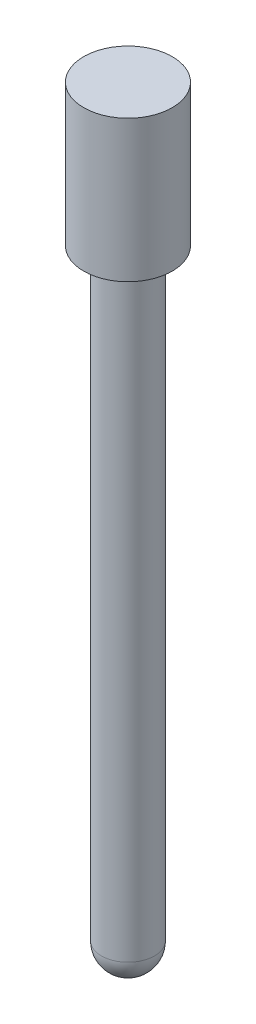
ISO-10303-21;
HEADER;
FILE_DESCRIPTION(('STEP AP214'),'2;1');
FILE_NAME('part.step','',(''),(''),'','','');
FILE_SCHEMA(('AUTOMOTIVE_DESIGN { 1 0 10303 214 1 1 1 1 }'));
ENDSEC;
DATA;
#1=APPLICATION_CONTEXT('core data for automotive mechanical design processes');
#2=APPLICATION_PROTOCOL_DEFINITION('international standard','automotive_design',2000,#1);
#3=PRODUCT_CONTEXT('',#1,'mechanical');
#4=PRODUCT('Part','Part','',(#3));
#5=PRODUCT_RELATED_PRODUCT_CATEGORY('part','',(#4));
#6=PRODUCT_DEFINITION_FORMATION('','',#4);
#7=PRODUCT_DEFINITION_CONTEXT('part definition',#1,'design');
#8=PRODUCT_DEFINITION('design','',#6,#7);
#9=PRODUCT_DEFINITION_SHAPE('','',#8);
#10=(LENGTH_UNIT() NAMED_UNIT(*) SI_UNIT(.MILLI.,.METRE.));
#11=(NAMED_UNIT(*) PLANE_ANGLE_UNIT() SI_UNIT($,.RADIAN.));
#12=(NAMED_UNIT(*) SI_UNIT($,.STERADIAN.) SOLID_ANGLE_UNIT());
#13=UNCERTAINTY_MEASURE_WITH_UNIT(LENGTH_MEASURE(1.E-05),#10,'distance_accuracy_value','');
#14=(GEOMETRIC_REPRESENTATION_CONTEXT(3) GLOBAL_UNCERTAINTY_ASSIGNED_CONTEXT((#13)) GLOBAL_UNIT_ASSIGNED_CONTEXT((#10,
#11,#12)) REPRESENTATION_CONTEXT('',''));
#15=CARTESIAN_POINT('',(0.,0.,0.));
#16=DIRECTION('',(0.,0.,1.));
#17=DIRECTION('',(1.,0.,0.));
#18=AXIS2_PLACEMENT_3D('',#15,#16,#17);
#19=CARTESIAN_POINT('',(0.,0.,0.));
#20=DIRECTION('',(0.,1.,0.));
#21=DIRECTION('',(0.,0.,1.));
#22=AXIS2_PLACEMENT_3D('',#19,#20,#21);
#23=PLANE('',#22);
#24=CARTESIAN_POINT('',(0.,0.,0.));
#25=DIRECTION('',(0.,1.,0.));
#26=DIRECTION('',(0.,0.,1.));
#27=AXIS2_PLACEMENT_3D('',#24,#25,#26);
#28=CIRCLE('',#27,7.9375);
#29=CARTESIAN_POINT('',(0.,0.,7.9375));
#30=VERTEX_POINT('',#29);
#31=EDGE_CURVE('E43',#30,#30,#28,.T.);
#32=ORIENTED_EDGE('',*,*,#31,.F.);
#33=EDGE_LOOP('',(#32));
#34=FACE_BOUND('',#33,.T.);
#35=CARTESIAN_POINT('',(0.,0.,0.));
#36=DIRECTION('',(0.,1.,0.));
#37=DIRECTION('',(0.,0.,1.));
#38=AXIS2_PLACEMENT_3D('',#35,#36,#37);
#39=CIRCLE('',#38,4.7625);
#40=CARTESIAN_POINT('',(0.,0.,4.7625));
#41=VERTEX_POINT('',#40);
#42=EDGE_CURVE('E10',#41,#41,#39,.F.);
#43=ORIENTED_EDGE('',*,*,#42,.F.);
#44=EDGE_LOOP('',(#43));
#45=FACE_BOUND('',#44,.T.);
#46=ADVANCED_FACE('F31',(#34,#45),#23,.F.);
#47=CARTESIAN_POINT('',(0.,25.4,0.));
#48=DIRECTION('',(0.,-1.,0.));
#49=DIRECTION('',(0.,0.,-1.));
#50=AXIS2_PLACEMENT_3D('',#47,#48,#49);
#51=CYLINDRICAL_SURFACE('',#50,7.9375);
#52=CARTESIAN_POINT('',(0.,25.4,0.));
#53=DIRECTION('',(0.,1.,0.));
#54=DIRECTION('',(0.,0.,1.));
#55=AXIS2_PLACEMENT_3D('',#52,#53,#54);
#56=CIRCLE('',#55,7.9375);
#57=CARTESIAN_POINT('',(0.,25.4,7.9375));
#58=VERTEX_POINT('',#57);
#59=EDGE_CURVE('E39',#58,#58,#56,.T.);
#60=ORIENTED_EDGE('',*,*,#59,.F.);
#61=EDGE_LOOP('',(#60));
#62=FACE_BOUND('',#61,.T.);
#63=ORIENTED_EDGE('',*,*,#31,.T.);
#64=EDGE_LOOP('',(#63));
#65=FACE_BOUND('',#64,.T.);
#66=ADVANCED_FACE('F61',(#62,#65),#51,.T.);
#67=CARTESIAN_POINT('',(0.,25.4,0.));
#68=DIRECTION('',(0.,1.,0.));
#69=DIRECTION('',(0.,0.,1.));
#70=AXIS2_PLACEMENT_3D('',#67,#68,#69);
#71=PLANE('',#70);
#72=ORIENTED_EDGE('',*,*,#59,.T.);
#73=EDGE_LOOP('',(#72));
#74=FACE_BOUND('',#73,.T.);
#75=ADVANCED_FACE('F55',(#74),#71,.T.);
#76=CARTESIAN_POINT('',(0.,-107.95,0.));
#77=DIRECTION('',(0.,1.,0.));
#78=DIRECTION('',(0.,0.,1.));
#79=AXIS2_PLACEMENT_3D('',#76,#77,#78);
#80=CYLINDRICAL_SURFACE('',#79,4.7625);
#81=CARTESIAN_POINT('',(0.,-107.95,0.));
#82=DIRECTION('',(0.,-1.,0.));
#83=DIRECTION('',(0.,0.,-1.));
#84=AXIS2_PLACEMENT_3D('',#81,#82,#83);
#85=CIRCLE('',#84,4.7625);
#86=CARTESIAN_POINT('',(0.,-107.95,-4.7625));
#87=VERTEX_POINT('',#86);
#88=EDGE_CURVE('E35',#87,#87,#85,.T.);
#89=ORIENTED_EDGE('',*,*,#88,.F.);
#90=EDGE_LOOP('',(#89));
#91=FACE_BOUND('',#90,.T.);
#92=ORIENTED_EDGE('',*,*,#42,.T.);
#93=EDGE_LOOP('',(#92));
#94=FACE_BOUND('',#93,.T.);
#95=ADVANCED_FACE('F53',(#91,#94),#80,.T.);
#96=CARTESIAN_POINT('',(0.,-107.95,0.));
#97=DIRECTION('',(0.,0.,1.));
#98=DIRECTION('',(1.,0.,0.));
#99=AXIS2_PLACEMENT_3D('',#96,#97,#98);
#100=SPHERICAL_SURFACE('',#99,4.7625);
#101=CARTESIAN_POINT('',(0.,-107.95,0.));
#102=DIRECTION('',(0.,-1.,0.));
#103=DIRECTION('',(0.,0.,-1.));
#104=AXIS2_PLACEMENT_3D('',#101,#102,#103);
#105=SPHERICAL_SURFACE('',#104,4.7625);
#106=ORIENTED_EDGE('',*,*,#88,.T.);
#107=EDGE_LOOP('',(#106));
#108=FACE_BOUND('',#107,.T.);
#109=ADVANCED_FACE('F33',(#108),#105,.T.);
#110=CLOSED_SHELL('',(#46,#66,#75,#95,#109));
#111=MANIFOLD_SOLID_BREP('B2',#110);
#112=ADVANCED_BREP_SHAPE_REPRESENTATION('',(#18,#111),#14);
#113=SHAPE_DEFINITION_REPRESENTATION(#9,#112);
ENDSEC;
END-ISO-10303-21;
